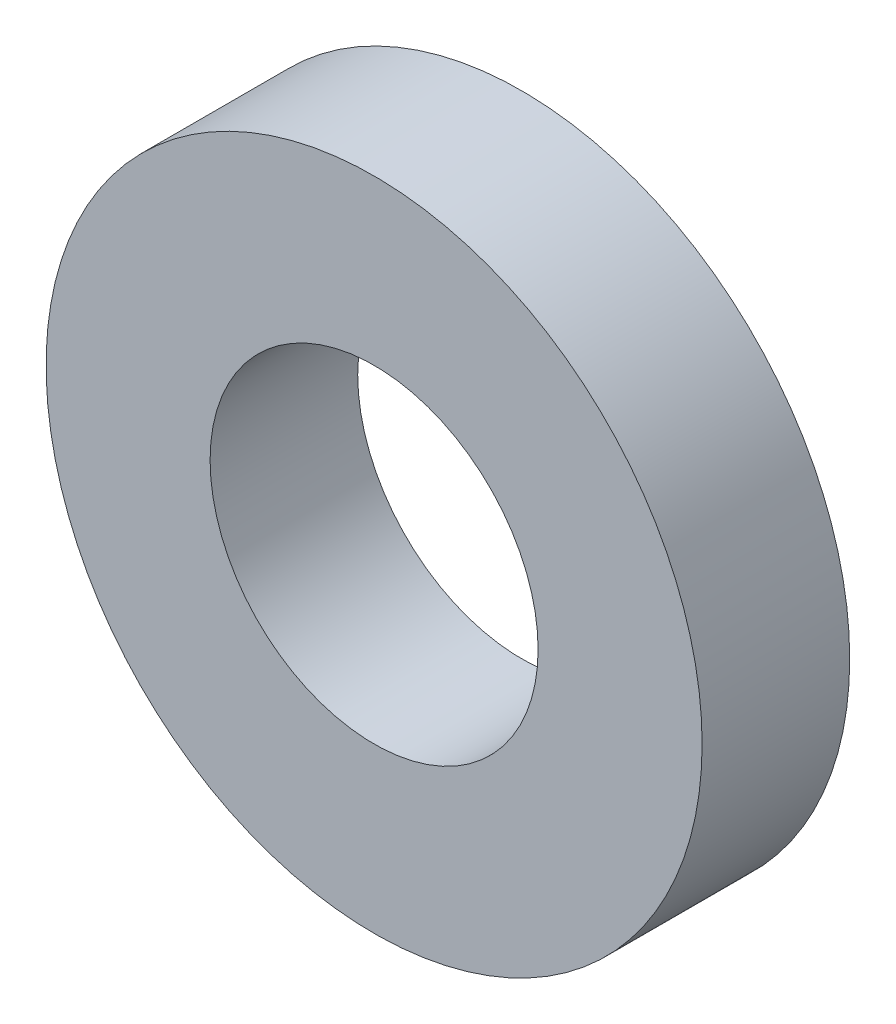
ISO-10303-21;
HEADER;
FILE_DESCRIPTION(('STEP AP214'),'2;1');
FILE_NAME('part.step','',(''),(''),'','','');
FILE_SCHEMA(('AUTOMOTIVE_DESIGN { 1 0 10303 214 1 1 1 1 }'));
ENDSEC;
DATA;
#1=APPLICATION_CONTEXT('core data for automotive mechanical design processes');
#2=APPLICATION_PROTOCOL_DEFINITION('international standard','automotive_design',2000,#1);
#3=PRODUCT_CONTEXT('',#1,'mechanical');
#4=PRODUCT('Part','Part','',(#3));
#5=PRODUCT_RELATED_PRODUCT_CATEGORY('part','',(#4));
#6=PRODUCT_DEFINITION_FORMATION('','',#4);
#7=PRODUCT_DEFINITION_CONTEXT('part definition',#1,'design');
#8=PRODUCT_DEFINITION('design','',#6,#7);
#9=PRODUCT_DEFINITION_SHAPE('','',#8);
#10=(LENGTH_UNIT() NAMED_UNIT(*) SI_UNIT(.MILLI.,.METRE.));
#11=(NAMED_UNIT(*) PLANE_ANGLE_UNIT() SI_UNIT($,.RADIAN.));
#12=(NAMED_UNIT(*) SI_UNIT($,.STERADIAN.) SOLID_ANGLE_UNIT());
#13=UNCERTAINTY_MEASURE_WITH_UNIT(LENGTH_MEASURE(1.E-05),#10,'distance_accuracy_value','');
#14=(GEOMETRIC_REPRESENTATION_CONTEXT(3) GLOBAL_UNCERTAINTY_ASSIGNED_CONTEXT((#13)) GLOBAL_UNIT_ASSIGNED_CONTEXT((#10,
#11,#12)) REPRESENTATION_CONTEXT('',''));
#15=CARTESIAN_POINT('',(0.,0.,0.));
#16=DIRECTION('',(0.,0.,1.));
#17=DIRECTION('',(1.,0.,0.));
#18=AXIS2_PLACEMENT_3D('',#15,#16,#17);
#19=CARTESIAN_POINT('',(0.,0.,18.));
#20=DIRECTION('',(0.,0.,1.));
#21=DIRECTION('',(1.,0.,0.));
#22=AXIS2_PLACEMENT_3D('',#19,#20,#21);
#23=PLANE('',#22);
#24=CARTESIAN_POINT('',(0.,0.,18.));
#25=DIRECTION('',(0.,0.,1.));
#26=DIRECTION('',(1.,0.,0.));
#27=AXIS2_PLACEMENT_3D('',#24,#25,#26);
#28=CIRCLE('',#27,40.);
#29=CARTESIAN_POINT('',(40.,0.,18.));
#30=VERTEX_POINT('',#29);
#31=EDGE_CURVE('E10',#30,#30,#28,.T.);
#32=ORIENTED_EDGE('',*,*,#31,.T.);
#33=EDGE_LOOP('',(#32));
#34=FACE_BOUND('',#33,.T.);
#35=CARTESIAN_POINT('',(0.,0.,18.));
#36=DIRECTION('',(0.,0.,1.));
#37=DIRECTION('',(1.,0.,0.));
#38=AXIS2_PLACEMENT_3D('',#35,#36,#37);
#39=CIRCLE('',#38,20.);
#40=CARTESIAN_POINT('',(20.,0.,18.));
#41=VERTEX_POINT('',#40);
#42=EDGE_CURVE('E44',#41,#41,#39,.T.);
#43=ORIENTED_EDGE('',*,*,#42,.F.);
#44=EDGE_LOOP('',(#43));
#45=FACE_BOUND('',#44,.T.);
#46=ADVANCED_FACE('F33',(#34,#45),#23,.T.);
#47=CARTESIAN_POINT('',(0.,0.,0.));
#48=DIRECTION('',(0.,0.,1.));
#49=DIRECTION('',(1.,0.,0.));
#50=AXIS2_PLACEMENT_3D('',#47,#48,#49);
#51=PLANE('',#50);
#52=CARTESIAN_POINT('',(0.,0.,0.));
#53=DIRECTION('',(0.,0.,1.));
#54=DIRECTION('',(1.,0.,0.));
#55=AXIS2_PLACEMENT_3D('',#52,#53,#54);
#56=CIRCLE('',#55,40.);
#57=CARTESIAN_POINT('',(40.,0.,0.));
#58=VERTEX_POINT('',#57);
#59=EDGE_CURVE('E37',#58,#58,#56,.T.);
#60=ORIENTED_EDGE('',*,*,#59,.F.);
#61=EDGE_LOOP('',(#60));
#62=FACE_BOUND('',#61,.T.);
#63=CARTESIAN_POINT('',(0.,0.,0.));
#64=DIRECTION('',(0.,0.,1.));
#65=DIRECTION('',(1.,0.,0.));
#66=AXIS2_PLACEMENT_3D('',#63,#64,#65);
#67=CIRCLE('',#66,20.);
#68=CARTESIAN_POINT('',(20.,0.,0.));
#69=VERTEX_POINT('',#68);
#70=EDGE_CURVE('E46',#69,#69,#67,.T.);
#71=ORIENTED_EDGE('',*,*,#70,.T.);
#72=EDGE_LOOP('',(#71));
#73=FACE_BOUND('',#72,.T.);
#74=ADVANCED_FACE('F56',(#62,#73),#51,.F.);
#75=CARTESIAN_POINT('',(0.,0.,18.));
#76=DIRECTION('',(0.,0.,-1.));
#77=DIRECTION('',(-1.,0.,0.));
#78=AXIS2_PLACEMENT_3D('',#75,#76,#77);
#79=CYLINDRICAL_SURFACE('',#78,40.);
#80=ORIENTED_EDGE('',*,*,#31,.F.);
#81=EDGE_LOOP('',(#80));
#82=FACE_BOUND('',#81,.T.);
#83=ORIENTED_EDGE('',*,*,#59,.T.);
#84=EDGE_LOOP('',(#83));
#85=FACE_BOUND('',#84,.T.);
#86=ADVANCED_FACE('F35',(#82,#85),#79,.T.);
#87=CARTESIAN_POINT('',(0.,0.,18.));
#88=DIRECTION('',(0.,0.,-1.));
#89=DIRECTION('',(-1.,0.,0.));
#90=AXIS2_PLACEMENT_3D('',#87,#88,#89);
#91=CYLINDRICAL_SURFACE('',#90,20.);
#92=ORIENTED_EDGE('',*,*,#42,.T.);
#93=EDGE_LOOP('',(#92));
#94=FACE_BOUND('',#93,.T.);
#95=ORIENTED_EDGE('',*,*,#70,.F.);
#96=EDGE_LOOP('',(#95));
#97=FACE_BOUND('',#96,.T.);
#98=ADVANCED_FACE('F52',(#94,#97),#91,.F.);
#99=CLOSED_SHELL('',(#46,#74,#86,#98));
#100=MANIFOLD_SOLID_BREP('B2',#99);
#101=ADVANCED_BREP_SHAPE_REPRESENTATION('',(#18,#100),#14);
#102=SHAPE_DEFINITION_REPRESENTATION(#9,#101);
ENDSEC;
END-ISO-10303-21;
